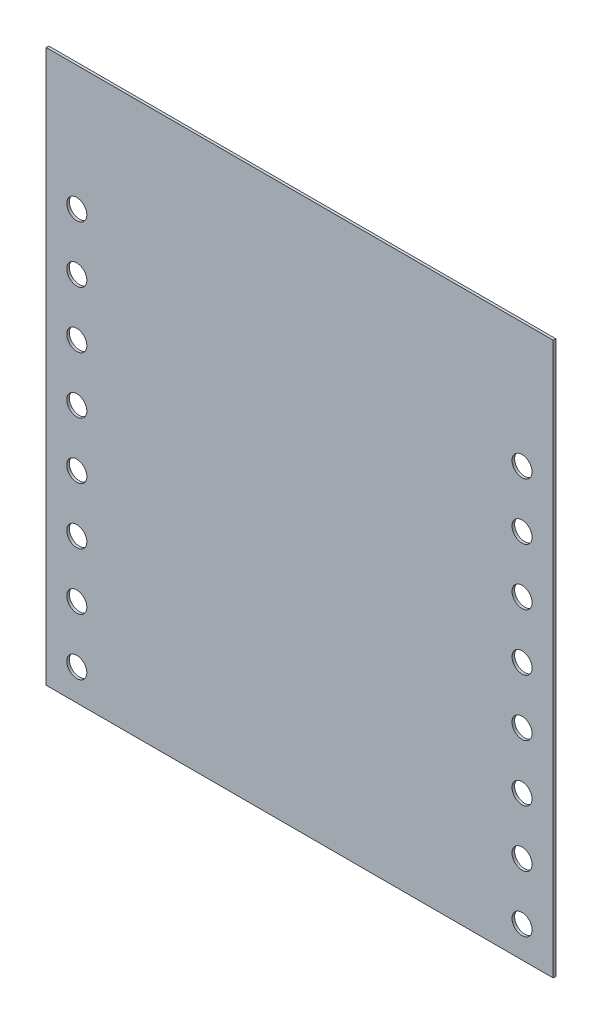
ISO-10303-21;
HEADER;
FILE_DESCRIPTION(('STEP AP214'),'2;1');
FILE_NAME('part.step','',(''),(''),'','','');
FILE_SCHEMA(('AUTOMOTIVE_DESIGN { 1 0 10303 214 1 1 1 1 }'));
ENDSEC;
DATA;
#1=APPLICATION_CONTEXT('core data for automotive mechanical design processes');
#2=APPLICATION_PROTOCOL_DEFINITION('international standard','automotive_design',2000,#1);
#3=PRODUCT_CONTEXT('',#1,'mechanical');
#4=PRODUCT('Part','Part','',(#3));
#5=PRODUCT_RELATED_PRODUCT_CATEGORY('part','',(#4));
#6=PRODUCT_DEFINITION_FORMATION('','',#4);
#7=PRODUCT_DEFINITION_CONTEXT('part definition',#1,'design');
#8=PRODUCT_DEFINITION('design','',#6,#7);
#9=PRODUCT_DEFINITION_SHAPE('','',#8);
#10=(LENGTH_UNIT() NAMED_UNIT(*) SI_UNIT(.MILLI.,.METRE.));
#11=(NAMED_UNIT(*) PLANE_ANGLE_UNIT() SI_UNIT($,.RADIAN.));
#12=(NAMED_UNIT(*) SI_UNIT($,.STERADIAN.) SOLID_ANGLE_UNIT());
#13=UNCERTAINTY_MEASURE_WITH_UNIT(LENGTH_MEASURE(1.E-05),#10,'distance_accuracy_value','');
#14=(GEOMETRIC_REPRESENTATION_CONTEXT(3) GLOBAL_UNCERTAINTY_ASSIGNED_CONTEXT((#13)) GLOBAL_UNIT_ASSIGNED_CONTEXT((#10,
#11,#12)) REPRESENTATION_CONTEXT('',''));
#15=CARTESIAN_POINT('',(0.,0.,0.));
#16=DIRECTION('',(0.,0.,1.));
#17=DIRECTION('',(1.,0.,0.));
#18=AXIS2_PLACEMENT_3D('',#15,#16,#17);
#19=CARTESIAN_POINT('',(0.,0.,0.11684));
#20=DIRECTION('',(0.,0.,-1.));
#21=DIRECTION('',(0.,-1.,0.));
#22=AXIS2_PLACEMENT_3D('',#19,#20,#21);
#23=PLANE('',#22);
#24=CARTESIAN_POINT('',(21.336,14.097,0.11684));
#25=DIRECTION('',(0.,0.,1.));
#26=DIRECTION('',(1.,0.,0.));
#27=AXIS2_PLACEMENT_3D('',#24,#25,#26);
#28=CIRCLE('',#27,0.4499991);
#29=CARTESIAN_POINT('',(21.7859991,14.097,0.11684));
#30=VERTEX_POINT('',#29);
#31=EDGE_CURVE('E27',#30,#30,#28,.T.);
#32=ORIENTED_EDGE('',*,*,#31,.F.);
#33=EDGE_LOOP('',(#32));
#34=FACE_BOUND('',#33,.T.);
#35=CARTESIAN_POINT('',(21.336,11.557,0.11684));
#36=DIRECTION('',(0.,0.,1.));
#37=DIRECTION('',(1.,0.,0.));
#38=AXIS2_PLACEMENT_3D('',#35,#36,#37);
#39=CIRCLE('',#38,0.4499991);
#40=CARTESIAN_POINT('',(21.7859991,11.557,0.11684));
#41=VERTEX_POINT('',#40);
#42=EDGE_CURVE('E143',#41,#41,#39,.T.);
#43=ORIENTED_EDGE('',*,*,#42,.F.);
#44=EDGE_LOOP('',(#43));
#45=FACE_BOUND('',#44,.T.);
#46=CARTESIAN_POINT('',(21.336,19.177,0.11684));
#47=DIRECTION('',(0.,0.,1.));
#48=DIRECTION('',(1.,0.,0.));
#49=AXIS2_PLACEMENT_3D('',#46,#47,#48);
#50=CIRCLE('',#49,0.4499991);
#51=CARTESIAN_POINT('',(21.7859991,19.177,0.11684));
#52=VERTEX_POINT('',#51);
#53=EDGE_CURVE('E289',#52,#52,#50,.T.);
#54=ORIENTED_EDGE('',*,*,#53,.F.);
#55=EDGE_LOOP('',(#54));
#56=FACE_BOUND('',#55,.T.);
#57=CARTESIAN_POINT('',(21.336,16.637,0.11684));
#58=DIRECTION('',(0.,0.,1.));
#59=DIRECTION('',(1.,0.,0.));
#60=AXIS2_PLACEMENT_3D('',#57,#58,#59);
#61=CIRCLE('',#60,0.4499991);
#62=CARTESIAN_POINT('',(21.7859991,16.637,0.11684));
#63=VERTEX_POINT('',#62);
#64=EDGE_CURVE('E192',#63,#63,#61,.T.);
#65=ORIENTED_EDGE('',*,*,#64,.F.);
#66=EDGE_LOOP('',(#65));
#67=FACE_BOUND('',#66,.T.);
#68=CARTESIAN_POINT('',(21.336,3.937,0.11684));
#69=DIRECTION('',(0.,0.,1.));
#70=DIRECTION('',(1.,0.,0.));
#71=AXIS2_PLACEMENT_3D('',#68,#69,#70);
#72=CIRCLE('',#71,0.4499991);
#73=CARTESIAN_POINT('',(21.7859991,3.937,0.11684));
#74=VERTEX_POINT('',#73);
#75=EDGE_CURVE('E212',#74,#74,#72,.T.);
#76=ORIENTED_EDGE('',*,*,#75,.F.);
#77=EDGE_LOOP('',(#76));
#78=FACE_BOUND('',#77,.T.);
#79=CARTESIAN_POINT('',(21.336,1.397,0.11684));
#80=DIRECTION('',(0.,0.,1.));
#81=DIRECTION('',(1.,0.,0.));
#82=AXIS2_PLACEMENT_3D('',#79,#80,#81);
#83=CIRCLE('',#82,0.4499991);
#84=CARTESIAN_POINT('',(21.7859991,1.397,0.11684));
#85=VERTEX_POINT('',#84);
#86=EDGE_CURVE('E366',#85,#85,#83,.T.);
#87=ORIENTED_EDGE('',*,*,#86,.F.);
#88=EDGE_LOOP('',(#87));
#89=FACE_BOUND('',#88,.T.);
#90=CARTESIAN_POINT('',(21.336,9.017,0.11684));
#91=DIRECTION('',(0.,0.,1.));
#92=DIRECTION('',(1.,0.,0.));
#93=AXIS2_PLACEMENT_3D('',#90,#91,#92);
#94=CIRCLE('',#93,0.4499991);
#95=CARTESIAN_POINT('',(21.7859991,9.017,0.11684));
#96=VERTEX_POINT('',#95);
#97=EDGE_CURVE('E330',#96,#96,#94,.T.);
#98=ORIENTED_EDGE('',*,*,#97,.F.);
#99=EDGE_LOOP('',(#98));
#100=FACE_BOUND('',#99,.T.);
#101=CARTESIAN_POINT('',(21.336,6.477,0.11684));
#102=DIRECTION('',(0.,0.,1.));
#103=DIRECTION('',(1.,0.,0.));
#104=AXIS2_PLACEMENT_3D('',#101,#102,#103);
#105=CIRCLE('',#104,0.4499991);
#106=CARTESIAN_POINT('',(21.7859991,6.477,0.11684));
#107=VERTEX_POINT('',#106);
#108=EDGE_CURVE('E169',#107,#107,#105,.T.);
#109=ORIENTED_EDGE('',*,*,#108,.F.);
#110=EDGE_LOOP('',(#109));
#111=FACE_BOUND('',#110,.T.);
#112=CARTESIAN_POINT('',(1.3716,14.097,0.11684));
#113=DIRECTION('',(0.,0.,1.));
#114=DIRECTION('',(1.,0.,0.));
#115=AXIS2_PLACEMENT_3D('',#112,#113,#114);
#116=CIRCLE('',#115,0.4499991);
#117=CARTESIAN_POINT('',(1.8215991,14.097,0.11684));
#118=VERTEX_POINT('',#117);
#119=EDGE_CURVE('E235',#118,#118,#116,.T.);
#120=ORIENTED_EDGE('',*,*,#119,.F.);
#121=EDGE_LOOP('',(#120));
#122=FACE_BOUND('',#121,.T.);
#123=CARTESIAN_POINT('',(1.3716,11.557,0.11684));
#124=DIRECTION('',(0.,0.,1.));
#125=DIRECTION('',(1.,0.,0.));
#126=AXIS2_PLACEMENT_3D('',#123,#124,#125);
#127=CIRCLE('',#126,0.4499991);
#128=CARTESIAN_POINT('',(1.8215991,11.557,0.11684));
#129=VERTEX_POINT('',#128);
#130=EDGE_CURVE('E309',#129,#129,#127,.T.);
#131=ORIENTED_EDGE('',*,*,#130,.F.);
#132=EDGE_LOOP('',(#131));
#133=FACE_BOUND('',#132,.T.);
#134=CARTESIAN_POINT('',(1.3716,19.177,0.11684));
#135=DIRECTION('',(0.,0.,1.));
#136=DIRECTION('',(1.,0.,0.));
#137=AXIS2_PLACEMENT_3D('',#134,#135,#136);
#138=CIRCLE('',#137,0.4499991);
#139=CARTESIAN_POINT('',(1.8215991,19.177,0.11684));
#140=VERTEX_POINT('',#139);
#141=EDGE_CURVE('E327',#140,#140,#138,.T.);
#142=ORIENTED_EDGE('',*,*,#141,.F.);
#143=EDGE_LOOP('',(#142));
#144=FACE_BOUND('',#143,.T.);
#145=CARTESIAN_POINT('',(1.3716,16.637,0.11684));
#146=DIRECTION('',(0.,0.,1.));
#147=DIRECTION('',(1.,0.,0.));
#148=AXIS2_PLACEMENT_3D('',#145,#146,#147);
#149=CIRCLE('',#148,0.4499991);
#150=CARTESIAN_POINT('',(1.8215991,16.637,0.11684));
#151=VERTEX_POINT('',#150);
#152=EDGE_CURVE('E76',#151,#151,#149,.T.);
#153=ORIENTED_EDGE('',*,*,#152,.F.);
#154=EDGE_LOOP('',(#153));
#155=FACE_BOUND('',#154,.T.);
#156=CARTESIAN_POINT('',(1.3716,3.937,0.11684));
#157=DIRECTION('',(0.,0.,1.));
#158=DIRECTION('',(1.,0.,0.));
#159=AXIS2_PLACEMENT_3D('',#156,#157,#158);
#160=CIRCLE('',#159,0.4499991);
#161=CARTESIAN_POINT('',(1.8215991,3.937,0.11684));
#162=VERTEX_POINT('',#161);
#163=EDGE_CURVE('E347',#162,#162,#160,.T.);
#164=ORIENTED_EDGE('',*,*,#163,.F.);
#165=EDGE_LOOP('',(#164));
#166=FACE_BOUND('',#165,.T.);
#167=CARTESIAN_POINT('',(1.3716,1.397,0.11684));
#168=DIRECTION('',(0.,0.,1.));
#169=DIRECTION('',(1.,0.,0.));
#170=AXIS2_PLACEMENT_3D('',#167,#168,#169);
#171=CIRCLE('',#170,0.4499991);
#172=CARTESIAN_POINT('',(1.8215991,1.397,0.11684));
#173=VERTEX_POINT('',#172);
#174=EDGE_CURVE('E314',#173,#173,#171,.T.);
#175=ORIENTED_EDGE('',*,*,#174,.F.);
#176=EDGE_LOOP('',(#175));
#177=FACE_BOUND('',#176,.T.);
#178=CARTESIAN_POINT('',(1.3716,9.017,0.11684));
#179=DIRECTION('',(0.,0.,1.));
#180=DIRECTION('',(1.,0.,0.));
#181=AXIS2_PLACEMENT_3D('',#178,#179,#180);
#182=CIRCLE('',#181,0.4499991);
#183=CARTESIAN_POINT('',(1.8215991,9.017,0.11684));
#184=VERTEX_POINT('',#183);
#185=EDGE_CURVE('E298',#184,#184,#182,.T.);
#186=ORIENTED_EDGE('',*,*,#185,.F.);
#187=EDGE_LOOP('',(#186));
#188=FACE_BOUND('',#187,.T.);
#189=CARTESIAN_POINT('',(1.3716,6.477,0.11684));
#190=DIRECTION('',(0.,0.,1.));
#191=DIRECTION('',(1.,0.,0.));
#192=AXIS2_PLACEMENT_3D('',#189,#190,#191);
#193=CIRCLE('',#192,0.4499991);
#194=CARTESIAN_POINT('',(1.8215991,6.477,0.11684));
#195=VERTEX_POINT('',#194);
#196=EDGE_CURVE('E357',#195,#195,#193,.T.);
#197=ORIENTED_EDGE('',*,*,#196,.F.);
#198=EDGE_LOOP('',(#197));
#199=FACE_BOUND('',#198,.T.);
#200=DIRECTION('',(1.,0.,0.));
#201=VECTOR('',#200,1.);
#202=CARTESIAN_POINT('',(0.,0.,0.11684));
#203=LINE('',#202,#201);
#204=CARTESIAN_POINT('',(0.,0.,0.11684));
#205=VERTEX_POINT('',#204);
#206=CARTESIAN_POINT('',(22.732999801636,0.,0.11684));
#207=VERTEX_POINT('',#206);
#208=EDGE_CURVE('E248',#205,#207,#203,.T.);
#209=ORIENTED_EDGE('',*,*,#208,.T.);
#210=DIRECTION('',(0.,1.,0.));
#211=VECTOR('',#210,1.);
#212=CARTESIAN_POINT('',(22.732999801636,0.,0.11684));
#213=LINE('',#212,#211);
#214=CARTESIAN_POINT('',(22.732999801636,24.764999389648,0.11684));
#215=VERTEX_POINT('',#214);
#216=EDGE_CURVE('E281',#207,#215,#213,.T.);
#217=ORIENTED_EDGE('',*,*,#216,.T.);
#218=DIRECTION('',(-1.,0.,0.));
#219=VECTOR('',#218,1.);
#220=CARTESIAN_POINT('',(22.732999801636,24.764999389648,0.11684));
#221=LINE('',#220,#219);
#222=CARTESIAN_POINT('',(0.,24.764999389648,0.11684));
#223=VERTEX_POINT('',#222);
#224=EDGE_CURVE('E286',#215,#223,#221,.T.);
#225=ORIENTED_EDGE('',*,*,#224,.T.);
#226=DIRECTION('',(0.,-1.,0.));
#227=VECTOR('',#226,1.);
#228=CARTESIAN_POINT('',(0.,24.764999389648,0.11684));
#229=LINE('',#228,#227);
#230=EDGE_CURVE('E285',#223,#205,#229,.T.);
#231=ORIENTED_EDGE('',*,*,#230,.T.);
#232=EDGE_LOOP('',(#209,#217,#225,#231));
#233=FACE_BOUND('',#232,.T.);
#234=ADVANCED_FACE('F16',(#34,#45,#56,#67,#78,#89,#100,#111,#122,#133,#144,#155,#166,#177,#188,
#199,#233),#23,.F.);
#235=CARTESIAN_POINT('',(0.,0.,0.));
#236=DIRECTION('',(0.,0.,-1.));
#237=DIRECTION('',(0.,-1.,0.));
#238=AXIS2_PLACEMENT_3D('',#235,#236,#237);
#239=PLANE('',#238);
#240=CARTESIAN_POINT('',(21.336,14.097,0.));
#241=DIRECTION('',(0.,0.,1.));
#242=DIRECTION('',(1.,0.,0.));
#243=AXIS2_PLACEMENT_3D('',#240,#241,#242);
#244=CIRCLE('',#243,0.4499991);
#245=CARTESIAN_POINT('',(21.7859991,14.097,0.));
#246=VERTEX_POINT('',#245);
#247=EDGE_CURVE('E11',#246,#246,#244,.T.);
#248=ORIENTED_EDGE('',*,*,#247,.T.);
#249=EDGE_LOOP('',(#248));
#250=FACE_BOUND('',#249,.T.);
#251=CARTESIAN_POINT('',(21.336,11.557,0.));
#252=DIRECTION('',(0.,0.,1.));
#253=DIRECTION('',(1.,0.,0.));
#254=AXIS2_PLACEMENT_3D('',#251,#252,#253);
#255=CIRCLE('',#254,0.4499991);
#256=CARTESIAN_POINT('',(21.7859991,11.557,0.));
#257=VERTEX_POINT('',#256);
#258=EDGE_CURVE('E132',#257,#257,#255,.T.);
#259=ORIENTED_EDGE('',*,*,#258,.T.);
#260=EDGE_LOOP('',(#259));
#261=FACE_BOUND('',#260,.T.);
#262=CARTESIAN_POINT('',(21.336,19.177,0.));
#263=DIRECTION('',(0.,0.,1.));
#264=DIRECTION('',(1.,0.,0.));
#265=AXIS2_PLACEMENT_3D('',#262,#263,#264);
#266=CIRCLE('',#265,0.4499991);
#267=CARTESIAN_POINT('',(21.7859991,19.177,0.));
#268=VERTEX_POINT('',#267);
#269=EDGE_CURVE('E277',#268,#268,#266,.T.);
#270=ORIENTED_EDGE('',*,*,#269,.T.);
#271=EDGE_LOOP('',(#270));
#272=FACE_BOUND('',#271,.T.);
#273=CARTESIAN_POINT('',(21.336,16.637,0.));
#274=DIRECTION('',(0.,0.,1.));
#275=DIRECTION('',(1.,0.,0.));
#276=AXIS2_PLACEMENT_3D('',#273,#274,#275);
#277=CIRCLE('',#276,0.4499991);
#278=CARTESIAN_POINT('',(21.7859991,16.637,0.));
#279=VERTEX_POINT('',#278);
#280=EDGE_CURVE('E201',#279,#279,#277,.T.);
#281=ORIENTED_EDGE('',*,*,#280,.T.);
#282=EDGE_LOOP('',(#281));
#283=FACE_BOUND('',#282,.T.);
#284=CARTESIAN_POINT('',(21.336,3.937,0.));
#285=DIRECTION('',(0.,0.,1.));
#286=DIRECTION('',(1.,0.,0.));
#287=AXIS2_PLACEMENT_3D('',#284,#285,#286);
#288=CIRCLE('',#287,0.4499991);
#289=CARTESIAN_POINT('',(21.7859991,3.937,0.));
#290=VERTEX_POINT('',#289);
#291=EDGE_CURVE('E310',#290,#290,#288,.T.);
#292=ORIENTED_EDGE('',*,*,#291,.T.);
#293=EDGE_LOOP('',(#292));
#294=FACE_BOUND('',#293,.T.);
#295=CARTESIAN_POINT('',(21.336,1.397,0.));
#296=DIRECTION('',(0.,0.,1.));
#297=DIRECTION('',(1.,0.,0.));
#298=AXIS2_PLACEMENT_3D('',#295,#296,#297);
#299=CIRCLE('',#298,0.4499991);
#300=CARTESIAN_POINT('',(21.7859991,1.397,0.));
#301=VERTEX_POINT('',#300);
#302=EDGE_CURVE('E273',#301,#301,#299,.T.);
#303=ORIENTED_EDGE('',*,*,#302,.T.);
#304=EDGE_LOOP('',(#303));
#305=FACE_BOUND('',#304,.T.);
#306=CARTESIAN_POINT('',(21.336,9.017,0.));
#307=DIRECTION('',(0.,0.,1.));
#308=DIRECTION('',(1.,0.,0.));
#309=AXIS2_PLACEMENT_3D('',#306,#307,#308);
#310=CIRCLE('',#309,0.4499991);
#311=CARTESIAN_POINT('',(21.7859991,9.017,0.));
#312=VERTEX_POINT('',#311);
#313=EDGE_CURVE('E333',#312,#312,#310,.T.);
#314=ORIENTED_EDGE('',*,*,#313,.T.);
#315=EDGE_LOOP('',(#314));
#316=FACE_BOUND('',#315,.T.);
#317=CARTESIAN_POINT('',(21.336,6.477,0.));
#318=DIRECTION('',(0.,0.,1.));
#319=DIRECTION('',(1.,0.,0.));
#320=AXIS2_PLACEMENT_3D('',#317,#318,#319);
#321=CIRCLE('',#320,0.4499991);
#322=CARTESIAN_POINT('',(21.7859991,6.477,0.));
#323=VERTEX_POINT('',#322);
#324=EDGE_CURVE('E158',#323,#323,#321,.T.);
#325=ORIENTED_EDGE('',*,*,#324,.T.);
#326=EDGE_LOOP('',(#325));
#327=FACE_BOUND('',#326,.T.);
#328=CARTESIAN_POINT('',(1.3716,14.097,0.));
#329=DIRECTION('',(0.,0.,1.));
#330=DIRECTION('',(1.,0.,0.));
#331=AXIS2_PLACEMENT_3D('',#328,#329,#330);
#332=CIRCLE('',#331,0.4499991);
#333=CARTESIAN_POINT('',(1.8215991,14.097,0.));
#334=VERTEX_POINT('',#333);
#335=EDGE_CURVE('E227',#334,#334,#332,.T.);
#336=ORIENTED_EDGE('',*,*,#335,.T.);
#337=EDGE_LOOP('',(#336));
#338=FACE_BOUND('',#337,.T.);
#339=CARTESIAN_POINT('',(1.3716,11.557,0.));
#340=DIRECTION('',(0.,0.,1.));
#341=DIRECTION('',(1.,0.,0.));
#342=AXIS2_PLACEMENT_3D('',#339,#340,#341);
#343=CIRCLE('',#342,0.4499991);
#344=CARTESIAN_POINT('',(1.8215991,11.557,0.));
#345=VERTEX_POINT('',#344);
#346=EDGE_CURVE('E323',#345,#345,#343,.T.);
#347=ORIENTED_EDGE('',*,*,#346,.T.);
#348=EDGE_LOOP('',(#347));
#349=FACE_BOUND('',#348,.T.);
#350=CARTESIAN_POINT('',(1.3716,19.177,0.));
#351=DIRECTION('',(0.,0.,1.));
#352=DIRECTION('',(1.,0.,0.));
#353=AXIS2_PLACEMENT_3D('',#350,#351,#352);
#354=CIRCLE('',#353,0.4499991);
#355=CARTESIAN_POINT('',(1.8215991,19.177,0.));
#356=VERTEX_POINT('',#355);
#357=EDGE_CURVE('E61',#356,#356,#354,.T.);
#358=ORIENTED_EDGE('',*,*,#357,.T.);
#359=EDGE_LOOP('',(#358));
#360=FACE_BOUND('',#359,.T.);
#361=CARTESIAN_POINT('',(1.3716,16.637,0.));
#362=DIRECTION('',(0.,0.,1.));
#363=DIRECTION('',(1.,0.,0.));
#364=AXIS2_PLACEMENT_3D('',#361,#362,#363);
#365=CIRCLE('',#364,0.4499991);
#366=CARTESIAN_POINT('',(1.8215991,16.637,0.));
#367=VERTEX_POINT('',#366);
#368=EDGE_CURVE('E290',#367,#367,#365,.T.);
#369=ORIENTED_EDGE('',*,*,#368,.T.);
#370=EDGE_LOOP('',(#369));
#371=FACE_BOUND('',#370,.T.);
#372=CARTESIAN_POINT('',(1.3716,3.937,0.));
#373=DIRECTION('',(0.,0.,1.));
#374=DIRECTION('',(1.,0.,0.));
#375=AXIS2_PLACEMENT_3D('',#372,#373,#374);
#376=CIRCLE('',#375,0.4499991);
#377=CARTESIAN_POINT('',(1.8215991,3.937,0.));
#378=VERTEX_POINT('',#377);
#379=EDGE_CURVE('E362',#378,#378,#376,.T.);
#380=ORIENTED_EDGE('',*,*,#379,.T.);
#381=EDGE_LOOP('',(#380));
#382=FACE_BOUND('',#381,.T.);
#383=CARTESIAN_POINT('',(1.3716,1.397,0.));
#384=DIRECTION('',(0.,0.,1.));
#385=DIRECTION('',(1.,0.,0.));
#386=AXIS2_PLACEMENT_3D('',#383,#384,#385);
#387=CIRCLE('',#386,0.4499991);
#388=CARTESIAN_POINT('',(1.8215991,1.397,0.));
#389=VERTEX_POINT('',#388);
#390=EDGE_CURVE('E317',#389,#389,#387,.T.);
#391=ORIENTED_EDGE('',*,*,#390,.T.);
#392=EDGE_LOOP('',(#391));
#393=FACE_BOUND('',#392,.T.);
#394=CARTESIAN_POINT('',(1.3716,9.017,0.));
#395=DIRECTION('',(0.,0.,1.));
#396=DIRECTION('',(1.,0.,0.));
#397=AXIS2_PLACEMENT_3D('',#394,#395,#396);
#398=CIRCLE('',#397,0.4499991);
#399=CARTESIAN_POINT('',(1.8215991,9.017,0.));
#400=VERTEX_POINT('',#399);
#401=EDGE_CURVE('E294',#400,#400,#398,.T.);
#402=ORIENTED_EDGE('',*,*,#401,.T.);
#403=EDGE_LOOP('',(#402));
#404=FACE_BOUND('',#403,.T.);
#405=CARTESIAN_POINT('',(1.3716,6.477,0.));
#406=DIRECTION('',(0.,0.,1.));
#407=DIRECTION('',(1.,0.,0.));
#408=AXIS2_PLACEMENT_3D('',#405,#406,#407);
#409=CIRCLE('',#408,0.4499991);
#410=CARTESIAN_POINT('',(1.8215991,6.477,0.));
#411=VERTEX_POINT('',#410);
#412=EDGE_CURVE('E385',#411,#411,#409,.T.);
#413=ORIENTED_EDGE('',*,*,#412,.T.);
#414=EDGE_LOOP('',(#413));
#415=FACE_BOUND('',#414,.T.);
#416=DIRECTION('',(0.,-1.,0.));
#417=VECTOR('',#416,1.);
#418=CARTESIAN_POINT('',(0.,24.764999389648,0.));
#419=LINE('',#418,#417);
#420=CARTESIAN_POINT('',(0.,24.764999389648,0.));
#421=VERTEX_POINT('',#420);
#422=CARTESIAN_POINT('',(0.,0.,0.));
#423=VERTEX_POINT('',#422);
#424=EDGE_CURVE('E282',#421,#423,#419,.T.);
#425=ORIENTED_EDGE('',*,*,#424,.F.);
#426=DIRECTION('',(-1.,0.,0.));
#427=VECTOR('',#426,1.);
#428=CARTESIAN_POINT('',(22.732999801636,24.764999389648,0.));
#429=LINE('',#428,#427);
#430=CARTESIAN_POINT('',(22.732999801636,24.764999389648,0.));
#431=VERTEX_POINT('',#430);
#432=EDGE_CURVE('E318',#431,#421,#429,.T.);
#433=ORIENTED_EDGE('',*,*,#432,.F.);
#434=DIRECTION('',(0.,1.,0.));
#435=VECTOR('',#434,1.);
#436=CARTESIAN_POINT('',(22.732999801636,0.,0.));
#437=LINE('',#436,#435);
#438=CARTESIAN_POINT('',(22.732999801636,0.,0.));
#439=VERTEX_POINT('',#438);
#440=EDGE_CURVE('E247',#439,#431,#437,.T.);
#441=ORIENTED_EDGE('',*,*,#440,.F.);
#442=DIRECTION('',(1.,0.,0.));
#443=VECTOR('',#442,1.);
#444=CARTESIAN_POINT('',(0.,0.,0.));
#445=LINE('',#444,#443);
#446=EDGE_CURVE('E269',#423,#439,#445,.T.);
#447=ORIENTED_EDGE('',*,*,#446,.F.);
#448=EDGE_LOOP('',(#425,#433,#441,#447));
#449=FACE_BOUND('',#448,.T.);
#450=ADVANCED_FACE('F228',(#250,#261,#272,#283,#294,#305,#316,#327,#338,#349,#360,#371,#382,
#393,#404,#415,#449),#239,.T.);
#451=CARTESIAN_POINT('',(21.336,14.097,0.));
#452=DIRECTION('',(0.,0.,-1.));
#453=DIRECTION('',(1.,0.,0.));
#454=AXIS2_PLACEMENT_3D('',#451,#452,#453);
#455=CYLINDRICAL_SURFACE('',#454,0.4499991);
#456=DIRECTION('',(0.,0.,1.));
#457=VECTOR('',#456,1.);
#458=CARTESIAN_POINT('',(21.7859991,14.097,0.));
#459=LINE('',#458,#457);
#460=EDGE_CURVE('E373',#246,#30,#459,.T.);
#461=ORIENTED_EDGE('',*,*,#460,.T.);
#462=ORIENTED_EDGE('',*,*,#31,.T.);
#463=ORIENTED_EDGE('',*,*,#460,.F.);
#464=ORIENTED_EDGE('',*,*,#247,.F.);
#465=EDGE_LOOP('',(#461,#462,#463,#464));
#466=FACE_BOUND('',#465,.T.);
#467=ADVANCED_FACE('F397',(#466),#455,.F.);
#468=CARTESIAN_POINT('',(21.336,11.557,0.));
#469=DIRECTION('',(0.,0.,-1.));
#470=DIRECTION('',(1.,0.,0.));
#471=AXIS2_PLACEMENT_3D('',#468,#469,#470);
#472=CYLINDRICAL_SURFACE('',#471,0.4499991);
#473=DIRECTION('',(0.,0.,1.));
#474=VECTOR('',#473,1.);
#475=CARTESIAN_POINT('',(21.7859991,11.557,0.));
#476=LINE('',#475,#474);
#477=EDGE_CURVE('E275',#257,#41,#476,.T.);
#478=ORIENTED_EDGE('',*,*,#477,.T.);
#479=ORIENTED_EDGE('',*,*,#42,.T.);
#480=ORIENTED_EDGE('',*,*,#477,.F.);
#481=ORIENTED_EDGE('',*,*,#258,.F.);
#482=EDGE_LOOP('',(#478,#479,#480,#481));
#483=FACE_BOUND('',#482,.T.);
#484=ADVANCED_FACE('F514',(#483),#472,.F.);
#485=CARTESIAN_POINT('',(21.336,19.177,0.));
#486=DIRECTION('',(0.,0.,-1.));
#487=DIRECTION('',(1.,0.,0.));
#488=AXIS2_PLACEMENT_3D('',#485,#486,#487);
#489=CYLINDRICAL_SURFACE('',#488,0.4499991);
#490=DIRECTION('',(0.,0.,1.));
#491=VECTOR('',#490,1.);
#492=CARTESIAN_POINT('',(21.7859991,19.177,0.));
#493=LINE('',#492,#491);
#494=EDGE_CURVE('E301',#268,#52,#493,.T.);
#495=ORIENTED_EDGE('',*,*,#494,.T.);
#496=ORIENTED_EDGE('',*,*,#53,.T.);
#497=ORIENTED_EDGE('',*,*,#494,.F.);
#498=ORIENTED_EDGE('',*,*,#269,.F.);
#499=EDGE_LOOP('',(#495,#496,#497,#498));
#500=FACE_BOUND('',#499,.T.);
#501=ADVANCED_FACE('F492',(#500),#489,.F.);
#502=CARTESIAN_POINT('',(21.336,16.637,0.));
#503=DIRECTION('',(0.,0.,-1.));
#504=DIRECTION('',(1.,0.,0.));
#505=AXIS2_PLACEMENT_3D('',#502,#503,#504);
#506=CYLINDRICAL_SURFACE('',#505,0.4499991);
#507=DIRECTION('',(0.,0.,1.));
#508=VECTOR('',#507,1.);
#509=CARTESIAN_POINT('',(21.7859991,16.637,0.));
#510=LINE('',#509,#508);
#511=EDGE_CURVE('E313',#279,#63,#510,.T.);
#512=ORIENTED_EDGE('',*,*,#511,.T.);
#513=ORIENTED_EDGE('',*,*,#64,.T.);
#514=ORIENTED_EDGE('',*,*,#511,.F.);
#515=ORIENTED_EDGE('',*,*,#280,.F.);
#516=EDGE_LOOP('',(#512,#513,#514,#515));
#517=FACE_BOUND('',#516,.T.);
#518=ADVANCED_FACE('F487',(#517),#506,.F.);
#519=CARTESIAN_POINT('',(21.336,3.937,0.));
#520=DIRECTION('',(0.,0.,-1.));
#521=DIRECTION('',(1.,0.,0.));
#522=AXIS2_PLACEMENT_3D('',#519,#520,#521);
#523=CYLINDRICAL_SURFACE('',#522,0.4499991);
#524=DIRECTION('',(0.,0.,1.));
#525=VECTOR('',#524,1.);
#526=CARTESIAN_POINT('',(21.7859991,3.937,0.));
#527=LINE('',#526,#525);
#528=EDGE_CURVE('E20',#290,#74,#527,.T.);
#529=ORIENTED_EDGE('',*,*,#528,.T.);
#530=ORIENTED_EDGE('',*,*,#75,.T.);
#531=ORIENTED_EDGE('',*,*,#528,.F.);
#532=ORIENTED_EDGE('',*,*,#291,.F.);
#533=EDGE_LOOP('',(#529,#530,#531,#532));
#534=FACE_BOUND('',#533,.T.);
#535=ADVANCED_FACE('F491',(#534),#523,.F.);
#536=CARTESIAN_POINT('',(21.336,1.397,0.));
#537=DIRECTION('',(0.,0.,-1.));
#538=DIRECTION('',(1.,0.,0.));
#539=AXIS2_PLACEMENT_3D('',#536,#537,#538);
#540=CYLINDRICAL_SURFACE('',#539,0.4499991);
#541=DIRECTION('',(0.,0.,1.));
#542=VECTOR('',#541,1.);
#543=CARTESIAN_POINT('',(21.7859991,1.397,0.));
#544=LINE('',#543,#542);
#545=EDGE_CURVE('E369',#301,#85,#544,.T.);
#546=ORIENTED_EDGE('',*,*,#545,.T.);
#547=ORIENTED_EDGE('',*,*,#86,.T.);
#548=ORIENTED_EDGE('',*,*,#545,.F.);
#549=ORIENTED_EDGE('',*,*,#302,.F.);
#550=EDGE_LOOP('',(#546,#547,#548,#549));
#551=FACE_BOUND('',#550,.T.);
#552=ADVANCED_FACE('F613',(#551),#540,.F.);
#553=CARTESIAN_POINT('',(21.336,9.017,0.));
#554=DIRECTION('',(0.,0.,-1.));
#555=DIRECTION('',(1.,0.,0.));
#556=AXIS2_PLACEMENT_3D('',#553,#554,#555);
#557=CYLINDRICAL_SURFACE('',#556,0.4499991);
#558=DIRECTION('',(0.,0.,1.));
#559=VECTOR('',#558,1.);
#560=CARTESIAN_POINT('',(21.7859991,9.017,0.));
#561=LINE('',#560,#559);
#562=EDGE_CURVE('E334',#312,#96,#561,.T.);
#563=ORIENTED_EDGE('',*,*,#562,.T.);
#564=ORIENTED_EDGE('',*,*,#97,.T.);
#565=ORIENTED_EDGE('',*,*,#562,.F.);
#566=ORIENTED_EDGE('',*,*,#313,.F.);
#567=EDGE_LOOP('',(#563,#564,#565,#566));
#568=FACE_BOUND('',#567,.T.);
#569=ADVANCED_FACE('F540',(#568),#557,.F.);
#570=CARTESIAN_POINT('',(21.336,6.477,0.));
#571=DIRECTION('',(0.,0.,-1.));
#572=DIRECTION('',(1.,0.,0.));
#573=AXIS2_PLACEMENT_3D('',#570,#571,#572);
#574=CYLINDRICAL_SURFACE('',#573,0.4499991);
#575=DIRECTION('',(0.,0.,1.));
#576=VECTOR('',#575,1.);
#577=CARTESIAN_POINT('',(21.7859991,6.477,0.));
#578=LINE('',#577,#576);
#579=EDGE_CURVE('E234',#323,#107,#578,.T.);
#580=ORIENTED_EDGE('',*,*,#579,.T.);
#581=ORIENTED_EDGE('',*,*,#108,.T.);
#582=ORIENTED_EDGE('',*,*,#579,.F.);
#583=ORIENTED_EDGE('',*,*,#324,.F.);
#584=EDGE_LOOP('',(#580,#581,#582,#583));
#585=FACE_BOUND('',#584,.T.);
#586=ADVANCED_FACE('F535',(#585),#574,.F.);
#587=CARTESIAN_POINT('',(1.3716,14.097,0.));
#588=DIRECTION('',(0.,0.,-1.));
#589=DIRECTION('',(1.,0.,0.));
#590=AXIS2_PLACEMENT_3D('',#587,#588,#589);
#591=CYLINDRICAL_SURFACE('',#590,0.4499991);
#592=DIRECTION('',(0.,0.,1.));
#593=VECTOR('',#592,1.);
#594=CARTESIAN_POINT('',(1.8215991,14.097,0.));
#595=LINE('',#594,#593);
#596=EDGE_CURVE('E242',#334,#118,#595,.T.);
#597=ORIENTED_EDGE('',*,*,#596,.T.);
#598=ORIENTED_EDGE('',*,*,#119,.T.);
#599=ORIENTED_EDGE('',*,*,#596,.F.);
#600=ORIENTED_EDGE('',*,*,#335,.F.);
#601=EDGE_LOOP('',(#597,#598,#599,#600));
#602=FACE_BOUND('',#601,.T.);
#603=ADVANCED_FACE('F539',(#602),#591,.F.);
#604=CARTESIAN_POINT('',(1.3716,11.557,0.));
#605=DIRECTION('',(0.,0.,-1.));
#606=DIRECTION('',(1.,0.,0.));
#607=AXIS2_PLACEMENT_3D('',#604,#605,#606);
#608=CYLINDRICAL_SURFACE('',#607,0.4499991);
#609=DIRECTION('',(0.,0.,1.));
#610=VECTOR('',#609,1.);
#611=CARTESIAN_POINT('',(1.8215991,11.557,0.));
#612=LINE('',#611,#610);
#613=EDGE_CURVE('E305',#345,#129,#612,.T.);
#614=ORIENTED_EDGE('',*,*,#613,.T.);
#615=ORIENTED_EDGE('',*,*,#130,.T.);
#616=ORIENTED_EDGE('',*,*,#613,.F.);
#617=ORIENTED_EDGE('',*,*,#346,.F.);
#618=EDGE_LOOP('',(#614,#615,#616,#617));
#619=FACE_BOUND('',#618,.T.);
#620=ADVANCED_FACE('F522',(#619),#608,.F.);
#621=CARTESIAN_POINT('',(1.3716,19.177,0.));
#622=DIRECTION('',(0.,0.,-1.));
#623=DIRECTION('',(1.,0.,0.));
#624=AXIS2_PLACEMENT_3D('',#621,#622,#623);
#625=CYLINDRICAL_SURFACE('',#624,0.4499991);
#626=DIRECTION('',(0.,0.,1.));
#627=VECTOR('',#626,1.);
#628=CARTESIAN_POINT('',(1.8215991,19.177,0.));
#629=LINE('',#628,#627);
#630=EDGE_CURVE('E293',#356,#140,#629,.T.);
#631=ORIENTED_EDGE('',*,*,#630,.T.);
#632=ORIENTED_EDGE('',*,*,#141,.T.);
#633=ORIENTED_EDGE('',*,*,#630,.F.);
#634=ORIENTED_EDGE('',*,*,#357,.F.);
#635=EDGE_LOOP('',(#631,#632,#633,#634));
#636=FACE_BOUND('',#635,.T.);
#637=ADVANCED_FACE('F483',(#636),#625,.F.);
#638=CARTESIAN_POINT('',(1.3716,16.637,0.));
#639=DIRECTION('',(0.,0.,-1.));
#640=DIRECTION('',(1.,0.,0.));
#641=AXIS2_PLACEMENT_3D('',#638,#639,#640);
#642=CYLINDRICAL_SURFACE('',#641,0.4499991);
#643=DIRECTION('',(0.,0.,1.));
#644=VECTOR('',#643,1.);
#645=CARTESIAN_POINT('',(1.8215991,16.637,0.));
#646=LINE('',#645,#644);
#647=EDGE_CURVE('E365',#367,#151,#646,.T.);
#648=ORIENTED_EDGE('',*,*,#647,.T.);
#649=ORIENTED_EDGE('',*,*,#152,.T.);
#650=ORIENTED_EDGE('',*,*,#647,.F.);
#651=ORIENTED_EDGE('',*,*,#368,.F.);
#652=EDGE_LOOP('',(#648,#649,#650,#651));
#653=FACE_BOUND('',#652,.T.);
#654=ADVANCED_FACE('F393',(#653),#642,.F.);
#655=CARTESIAN_POINT('',(1.3716,3.937,0.));
#656=DIRECTION('',(0.,0.,-1.));
#657=DIRECTION('',(1.,0.,0.));
#658=AXIS2_PLACEMENT_3D('',#655,#656,#657);
#659=CYLINDRICAL_SURFACE('',#658,0.4499991);
#660=DIRECTION('',(0.,0.,1.));
#661=VECTOR('',#660,1.);
#662=CARTESIAN_POINT('',(1.8215991,3.937,0.));
#663=LINE('',#662,#661);
#664=EDGE_CURVE('E343',#378,#162,#663,.T.);
#665=ORIENTED_EDGE('',*,*,#664,.T.);
#666=ORIENTED_EDGE('',*,*,#163,.T.);
#667=ORIENTED_EDGE('',*,*,#664,.F.);
#668=ORIENTED_EDGE('',*,*,#379,.F.);
#669=EDGE_LOOP('',(#665,#666,#667,#668));
#670=FACE_BOUND('',#669,.T.);
#671=ADVANCED_FACE('F18',(#670),#659,.F.);
#672=CARTESIAN_POINT('',(1.3716,1.397,0.));
#673=DIRECTION('',(0.,0.,-1.));
#674=DIRECTION('',(1.,0.,0.));
#675=AXIS2_PLACEMENT_3D('',#672,#673,#674);
#676=CYLINDRICAL_SURFACE('',#675,0.4499991);
#677=DIRECTION('',(0.,0.,1.));
#678=VECTOR('',#677,1.);
#679=CARTESIAN_POINT('',(1.8215991,1.397,0.));
#680=LINE('',#679,#678);
#681=EDGE_CURVE('E297',#389,#173,#680,.T.);
#682=ORIENTED_EDGE('',*,*,#681,.T.);
#683=ORIENTED_EDGE('',*,*,#174,.T.);
#684=ORIENTED_EDGE('',*,*,#681,.F.);
#685=ORIENTED_EDGE('',*,*,#390,.F.);
#686=EDGE_LOOP('',(#682,#683,#684,#685));
#687=FACE_BOUND('',#686,.T.);
#688=ADVANCED_FACE('F473',(#687),#676,.F.);
#689=CARTESIAN_POINT('',(1.3716,9.017,0.));
#690=DIRECTION('',(0.,0.,-1.));
#691=DIRECTION('',(1.,0.,0.));
#692=AXIS2_PLACEMENT_3D('',#689,#690,#691);
#693=CYLINDRICAL_SURFACE('',#692,0.4499991);
#694=DIRECTION('',(0.,0.,1.));
#695=VECTOR('',#694,1.);
#696=CARTESIAN_POINT('',(1.8215991,9.017,0.));
#697=LINE('',#696,#695);
#698=EDGE_CURVE('E381',#400,#184,#697,.T.);
#699=ORIENTED_EDGE('',*,*,#698,.T.);
#700=ORIENTED_EDGE('',*,*,#185,.T.);
#701=ORIENTED_EDGE('',*,*,#698,.F.);
#702=ORIENTED_EDGE('',*,*,#401,.F.);
#703=EDGE_LOOP('',(#699,#700,#701,#702));
#704=FACE_BOUND('',#703,.T.);
#705=ADVANCED_FACE('F446',(#704),#693,.F.);
#706=CARTESIAN_POINT('',(1.3716,6.477,0.));
#707=DIRECTION('',(0.,0.,-1.));
#708=DIRECTION('',(1.,0.,0.));
#709=AXIS2_PLACEMENT_3D('',#706,#707,#708);
#710=CYLINDRICAL_SURFACE('',#709,0.4499991);
#711=DIRECTION('',(0.,0.,1.));
#712=VECTOR('',#711,1.);
#713=CARTESIAN_POINT('',(1.8215991,6.477,0.));
#714=LINE('',#713,#712);
#715=EDGE_CURVE('E304',#411,#195,#714,.T.);
#716=ORIENTED_EDGE('',*,*,#715,.T.);
#717=ORIENTED_EDGE('',*,*,#196,.T.);
#718=ORIENTED_EDGE('',*,*,#715,.F.);
#719=ORIENTED_EDGE('',*,*,#412,.F.);
#720=EDGE_LOOP('',(#716,#717,#718,#719));
#721=FACE_BOUND('',#720,.T.);
#722=ADVANCED_FACE('F459',(#721),#710,.F.);
#723=CARTESIAN_POINT('',(0.,24.764999389648,0.));
#724=DIRECTION('',(1.,0.,0.));
#725=DIRECTION('',(0.,1.,0.));
#726=AXIS2_PLACEMENT_3D('',#723,#724,#725);
#727=PLANE('',#726);
#728=ORIENTED_EDGE('',*,*,#424,.T.);
#729=DIRECTION('',(0.,0.,1.));
#730=VECTOR('',#729,1.);
#731=CARTESIAN_POINT('',(0.,0.,0.));
#732=LINE('',#731,#730);
#733=EDGE_CURVE('E245',#423,#205,#732,.T.);
#734=ORIENTED_EDGE('',*,*,#733,.T.);
#735=ORIENTED_EDGE('',*,*,#230,.F.);
#736=DIRECTION('',(0.,0.,1.));
#737=VECTOR('',#736,1.);
#738=CARTESIAN_POINT('',(0.,24.764999389648,0.));
#739=LINE('',#738,#737);
#740=EDGE_CURVE('E322',#421,#223,#739,.T.);
#741=ORIENTED_EDGE('',*,*,#740,.F.);
#742=EDGE_LOOP('',(#728,#734,#735,#741));
#743=FACE_BOUND('',#742,.T.);
#744=ADVANCED_FACE('F415',(#743),#727,.F.);
#745=CARTESIAN_POINT('',(22.732999801636,24.764999389648,0.));
#746=DIRECTION('',(0.,-1.,0.));
#747=DIRECTION('',(0.,0.,-1.));
#748=AXIS2_PLACEMENT_3D('',#745,#746,#747);
#749=PLANE('',#748);
#750=ORIENTED_EDGE('',*,*,#432,.T.);
#751=ORIENTED_EDGE('',*,*,#740,.T.);
#752=ORIENTED_EDGE('',*,*,#224,.F.);
#753=DIRECTION('',(0.,0.,1.));
#754=VECTOR('',#753,1.);
#755=CARTESIAN_POINT('',(22.732999801636,24.764999389648,0.));
#756=LINE('',#755,#754);
#757=EDGE_CURVE('E256',#431,#215,#756,.T.);
#758=ORIENTED_EDGE('',*,*,#757,.F.);
#759=EDGE_LOOP('',(#750,#751,#752,#758));
#760=FACE_BOUND('',#759,.T.);
#761=ADVANCED_FACE('F421',(#760),#749,.F.);
#762=CARTESIAN_POINT('',(22.732999801636,0.,0.));
#763=DIRECTION('',(-1.,0.,0.));
#764=DIRECTION('',(0.,0.,1.));
#765=AXIS2_PLACEMENT_3D('',#762,#763,#764);
#766=PLANE('',#765);
#767=ORIENTED_EDGE('',*,*,#440,.T.);
#768=ORIENTED_EDGE('',*,*,#757,.T.);
#769=ORIENTED_EDGE('',*,*,#216,.F.);
#770=DIRECTION('',(0.,0.,1.));
#771=VECTOR('',#770,1.);
#772=CARTESIAN_POINT('',(22.732999801636,0.,0.));
#773=LINE('',#772,#771);
#774=EDGE_CURVE('E260',#439,#207,#773,.T.);
#775=ORIENTED_EDGE('',*,*,#774,.F.);
#776=EDGE_LOOP('',(#767,#768,#769,#775));
#777=FACE_BOUND('',#776,.T.);
#778=ADVANCED_FACE('F426',(#777),#766,.F.);
#779=CARTESIAN_POINT('',(0.,0.,0.));
#780=DIRECTION('',(0.,1.,0.));
#781=DIRECTION('',(1.,0.,0.));
#782=AXIS2_PLACEMENT_3D('',#779,#780,#781);
#783=PLANE('',#782);
#784=ORIENTED_EDGE('',*,*,#446,.T.);
#785=ORIENTED_EDGE('',*,*,#774,.T.);
#786=ORIENTED_EDGE('',*,*,#208,.F.);
#787=ORIENTED_EDGE('',*,*,#733,.F.);
#788=EDGE_LOOP('',(#784,#785,#786,#787));
#789=FACE_BOUND('',#788,.T.);
#790=ADVANCED_FACE('F428',(#789),#783,.F.);
#791=CLOSED_SHELL('',(#234,#450,#467,#484,#501,#518,#535,#552,#569,#586,#603,#620,#637,#654,
#671,#688,#705,#722,#744,#761,#778,#790));
#792=MANIFOLD_SOLID_BREP('B1',#791);
#793=ADVANCED_BREP_SHAPE_REPRESENTATION('',(#18,#792),#14);
#794=SHAPE_DEFINITION_REPRESENTATION(#9,#793);
ENDSEC;
END-ISO-10303-21;
